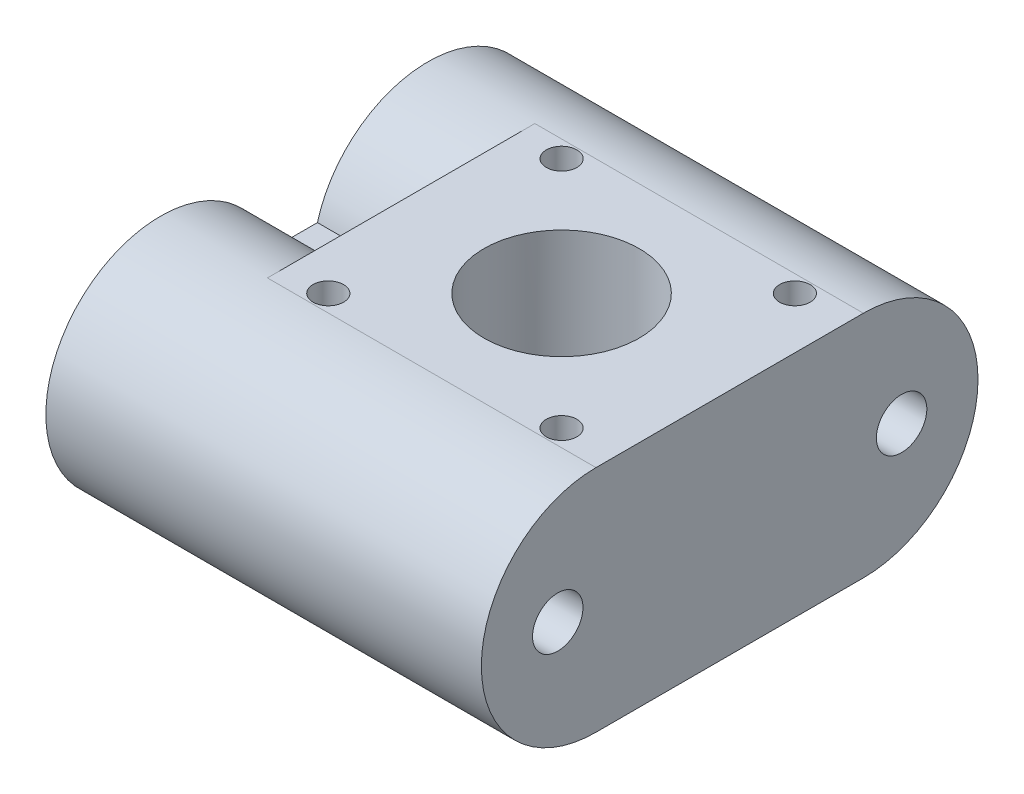
ISO-10303-21;
HEADER;
FILE_DESCRIPTION(('STEP AP214'),'2;1');
FILE_NAME('part.step','',(''),(''),'','','');
FILE_SCHEMA(('AUTOMOTIVE_DESIGN { 1 0 10303 214 1 1 1 1 }'));
ENDSEC;
DATA;
#1=APPLICATION_CONTEXT('core data for automotive mechanical design processes');
#2=APPLICATION_PROTOCOL_DEFINITION('international standard','automotive_design',2000,#1);
#3=PRODUCT_CONTEXT('',#1,'mechanical');
#4=PRODUCT('Part','Part','',(#3));
#5=PRODUCT_RELATED_PRODUCT_CATEGORY('part','',(#4));
#6=PRODUCT_DEFINITION_FORMATION('','',#4);
#7=PRODUCT_DEFINITION_CONTEXT('part definition',#1,'design');
#8=PRODUCT_DEFINITION('design','',#6,#7);
#9=PRODUCT_DEFINITION_SHAPE('','',#8);
#10=(LENGTH_UNIT() NAMED_UNIT(*) SI_UNIT(.MILLI.,.METRE.));
#11=(NAMED_UNIT(*) PLANE_ANGLE_UNIT() SI_UNIT($,.RADIAN.));
#12=(NAMED_UNIT(*) SI_UNIT($,.STERADIAN.) SOLID_ANGLE_UNIT());
#13=UNCERTAINTY_MEASURE_WITH_UNIT(LENGTH_MEASURE(1.E-05),#10,'distance_accuracy_value','');
#14=(GEOMETRIC_REPRESENTATION_CONTEXT(3) GLOBAL_UNCERTAINTY_ASSIGNED_CONTEXT((#13)) GLOBAL_UNIT_ASSIGNED_CONTEXT((#10,
#11,#12)) REPRESENTATION_CONTEXT('',''));
#15=CARTESIAN_POINT('',(0.,0.,0.));
#16=DIRECTION('',(0.,0.,1.));
#17=DIRECTION('',(1.,0.,0.));
#18=AXIS2_PLACEMENT_3D('',#15,#16,#17);
#19=CARTESIAN_POINT('',(-17.5,-15.,16.25));
#20=DIRECTION('',(-1.,0.,0.));
#21=DIRECTION('',(0.,0.,1.));
#22=AXIS2_PLACEMENT_3D('',#19,#20,#21);
#23=PLANE('',#22);
#24=CARTESIAN_POINT('',(-17.5,-7.5,-11.25));
#25=DIRECTION('',(-1.,0.,0.));
#26=DIRECTION('',(0.,0.,1.));
#27=AXIS2_PLACEMENT_3D('',#24,#25,#26);
#28=CIRCLE('',#27,1.65);
#29=CARTESIAN_POINT('',(-17.5,-7.5,-9.6));
#30=VERTEX_POINT('',#29);
#31=EDGE_CURVE('E172',#30,#30,#28,.T.);
#32=ORIENTED_EDGE('',*,*,#31,.F.);
#33=EDGE_LOOP('',(#32));
#34=FACE_BOUND('',#33,.T.);
#35=CARTESIAN_POINT('',(-17.5,-7.5,11.25));
#36=DIRECTION('',(-1.,0.,0.));
#37=DIRECTION('',(0.,0.,1.));
#38=AXIS2_PLACEMENT_3D('',#35,#36,#37);
#39=CIRCLE('',#38,1.65);
#40=CARTESIAN_POINT('',(-17.5,-7.5,12.9));
#41=VERTEX_POINT('',#40);
#42=EDGE_CURVE('E175',#41,#41,#39,.T.);
#43=ORIENTED_EDGE('',*,*,#42,.F.);
#44=EDGE_LOOP('',(#43));
#45=FACE_BOUND('',#44,.T.);
#46=DIRECTION('',(0.,0.,1.));
#47=VECTOR('',#46,1.);
#48=CARTESIAN_POINT('',(-17.5,-5.5,0.));
#49=LINE('',#48,#47);
#50=CARTESIAN_POINT('',(-17.5,-5.5,-1.52158385259952));
#51=VERTEX_POINT('',#50);
#52=CARTESIAN_POINT('',(-17.5,-5.5,1.52158385259952));
#53=VERTEX_POINT('',#52);
#54=EDGE_CURVE('E137',#51,#53,#49,.T.);
#55=ORIENTED_EDGE('',*,*,#54,.F.);
#56=CARTESIAN_POINT('',(-17.5,-7.5,-8.75));
#57=DIRECTION('',(-1.,0.,0.));
#58=DIRECTION('',(0.,0.,1.));
#59=AXIS2_PLACEMENT_3D('',#56,#57,#58);
#60=CIRCLE('',#59,7.5);
#61=CARTESIAN_POINT('',(-17.5,-9.5,-1.52158385259952));
#62=VERTEX_POINT('',#61);
#63=EDGE_CURVE('E213',#51,#62,#60,.T.);
#64=ORIENTED_EDGE('',*,*,#63,.T.);
#65=DIRECTION('',(0.,0.,1.));
#66=VECTOR('',#65,1.);
#67=CARTESIAN_POINT('',(-17.5,-9.5,0.));
#68=LINE('',#67,#66);
#69=CARTESIAN_POINT('',(-17.5,-9.5,1.52158385259952));
#70=VERTEX_POINT('',#69);
#71=EDGE_CURVE('E146',#62,#70,#68,.T.);
#72=ORIENTED_EDGE('',*,*,#71,.T.);
#73=CARTESIAN_POINT('',(-17.5,-7.5,8.75));
#74=DIRECTION('',(-1.,0.,0.));
#75=DIRECTION('',(0.,0.,1.));
#76=AXIS2_PLACEMENT_3D('',#73,#74,#75);
#77=CIRCLE('',#76,7.5);
#78=EDGE_CURVE('E73',#70,#53,#77,.T.);
#79=ORIENTED_EDGE('',*,*,#78,.T.);
#80=EDGE_LOOP('',(#55,#64,#72,#79));
#81=FACE_BOUND('',#80,.T.);
#82=ADVANCED_FACE('F64',(#34,#45,#81),#23,.T.);
#83=CARTESIAN_POINT('',(0.,-15.,0.));
#84=DIRECTION('',(0.,-1.,0.));
#85=DIRECTION('',(0.,0.,-1.));
#86=AXIS2_PLACEMENT_3D('',#83,#84,#85);
#87=PLANE('',#86);
#88=CARTESIAN_POINT('',(7.633,-15.,7.633));
#89=DIRECTION('',(0.,1.,0.));
#90=DIRECTION('',(0.,0.,1.));
#91=AXIS2_PLACEMENT_3D('',#88,#89,#90);
#92=CIRCLE('',#91,1.);
#93=CARTESIAN_POINT('',(7.633,-15.,8.633));
#94=VERTEX_POINT('',#93);
#95=EDGE_CURVE('E179',#94,#94,#92,.T.);
#96=ORIENTED_EDGE('',*,*,#95,.T.);
#97=EDGE_LOOP('',(#96));
#98=FACE_BOUND('',#97,.T.);
#99=CARTESIAN_POINT('',(-7.633,-15.,7.633));
#100=DIRECTION('',(0.,1.,0.));
#101=DIRECTION('',(0.,0.,1.));
#102=AXIS2_PLACEMENT_3D('',#99,#100,#101);
#103=CIRCLE('',#102,1.);
#104=CARTESIAN_POINT('',(-7.633,-15.,8.633));
#105=VERTEX_POINT('',#104);
#106=EDGE_CURVE('E185',#105,#105,#103,.T.);
#107=ORIENTED_EDGE('',*,*,#106,.T.);
#108=EDGE_LOOP('',(#107));
#109=FACE_BOUND('',#108,.T.);
#110=CARTESIAN_POINT('',(-7.633,-15.,-7.633));
#111=DIRECTION('',(0.,1.,0.));
#112=DIRECTION('',(0.,0.,1.));
#113=AXIS2_PLACEMENT_3D('',#110,#111,#112);
#114=CIRCLE('',#113,1.);
#115=CARTESIAN_POINT('',(-7.633,-15.,-6.633));
#116=VERTEX_POINT('',#115);
#117=EDGE_CURVE('E191',#116,#116,#114,.T.);
#118=ORIENTED_EDGE('',*,*,#117,.T.);
#119=EDGE_LOOP('',(#118));
#120=FACE_BOUND('',#119,.T.);
#121=CARTESIAN_POINT('',(7.633,-15.,-7.633));
#122=DIRECTION('',(0.,1.,0.));
#123=DIRECTION('',(0.,0.,1.));
#124=AXIS2_PLACEMENT_3D('',#121,#122,#123);
#125=CIRCLE('',#124,0.999999999999999);
#126=CARTESIAN_POINT('',(7.633,-15.,-6.633));
#127=VERTEX_POINT('',#126);
#128=EDGE_CURVE('E197',#127,#127,#125,.T.);
#129=ORIENTED_EDGE('',*,*,#128,.T.);
#130=EDGE_LOOP('',(#129));
#131=FACE_BOUND('',#130,.T.);
#132=CARTESIAN_POINT('',(0.,-15.,0.));
#133=DIRECTION('',(0.,-1.,0.));
#134=DIRECTION('',(0.,0.,-1.));
#135=AXIS2_PLACEMENT_3D('',#132,#133,#134);
#136=CIRCLE('',#135,5.08);
#137=CARTESIAN_POINT('',(0.,-15.,-5.08));
#138=VERTEX_POINT('',#137);
#139=EDGE_CURVE('E205',#138,#138,#136,.T.);
#140=ORIENTED_EDGE('',*,*,#139,.F.);
#141=EDGE_LOOP('',(#140));
#142=FACE_BOUND('',#141,.T.);
#143=DIRECTION('',(1.,0.,0.));
#144=VECTOR('',#143,1.);
#145=CARTESIAN_POINT('',(0.,-15.,8.75));
#146=LINE('',#145,#144);
#147=CARTESIAN_POINT('',(11.,-15.,8.75));
#148=VERTEX_POINT('',#147);
#149=CARTESIAN_POINT('',(-10.5,-15.,8.75));
#150=VERTEX_POINT('',#149);
#151=EDGE_CURVE('E217',#148,#150,#146,.F.);
#152=ORIENTED_EDGE('',*,*,#151,.T.);
#153=DIRECTION('',(0.,0.,-1.));
#154=VECTOR('',#153,1.);
#155=CARTESIAN_POINT('',(-10.5,-15.,0.));
#156=LINE('',#155,#154);
#157=CARTESIAN_POINT('',(-10.5,-15.,-8.75));
#158=VERTEX_POINT('',#157);
#159=EDGE_CURVE('E135',#150,#158,#156,.T.);
#160=ORIENTED_EDGE('',*,*,#159,.T.);
#161=DIRECTION('',(-1.,0.,0.));
#162=VECTOR('',#161,1.);
#163=CARTESIAN_POINT('',(0.,-15.,-8.75));
#164=LINE('',#163,#162);
#165=CARTESIAN_POINT('',(11.,-15.,-8.75));
#166=VERTEX_POINT('',#165);
#167=EDGE_CURVE('E208',#158,#166,#164,.F.);
#168=ORIENTED_EDGE('',*,*,#167,.T.);
#169=DIRECTION('',(0.,0.,-1.));
#170=VECTOR('',#169,1.);
#171=CARTESIAN_POINT('',(11.,-15.,16.25));
#172=LINE('',#171,#170);
#173=EDGE_CURVE('E161',#148,#166,#172,.T.);
#174=ORIENTED_EDGE('',*,*,#173,.F.);
#175=EDGE_LOOP('',(#152,#160,#168,#174));
#176=FACE_BOUND('',#175,.T.);
#177=ADVANCED_FACE('F241',(#98,#109,#120,#131,#142,#176),#87,.T.);
#178=CARTESIAN_POINT('',(0.,0.,0.));
#179=DIRECTION('',(0.,-1.,0.));
#180=DIRECTION('',(0.,0.,-1.));
#181=AXIS2_PLACEMENT_3D('',#178,#179,#180);
#182=PLANE('',#181);
#183=CARTESIAN_POINT('',(0.,0.,0.));
#184=DIRECTION('',(0.,1.,0.));
#185=DIRECTION('',(0.,0.,1.));
#186=AXIS2_PLACEMENT_3D('',#183,#184,#185);
#187=CIRCLE('',#186,5.08);
#188=CARTESIAN_POINT('',(0.,0.,5.08));
#189=VERTEX_POINT('',#188);
#190=EDGE_CURVE('E200',#189,#189,#187,.T.);
#191=ORIENTED_EDGE('',*,*,#190,.F.);
#192=EDGE_LOOP('',(#191));
#193=FACE_BOUND('',#192,.T.);
#194=CARTESIAN_POINT('',(7.633,0.,-7.633));
#195=DIRECTION('',(0.,1.,0.));
#196=DIRECTION('',(0.,0.,1.));
#197=AXIS2_PLACEMENT_3D('',#194,#195,#196);
#198=CIRCLE('',#197,0.999999999999999);
#199=CARTESIAN_POINT('',(7.633,0.,-6.633));
#200=VERTEX_POINT('',#199);
#201=EDGE_CURVE('E194',#200,#200,#198,.T.);
#202=ORIENTED_EDGE('',*,*,#201,.F.);
#203=EDGE_LOOP('',(#202));
#204=FACE_BOUND('',#203,.T.);
#205=CARTESIAN_POINT('',(-7.633,0.,-7.633));
#206=DIRECTION('',(0.,1.,0.));
#207=DIRECTION('',(0.,0.,1.));
#208=AXIS2_PLACEMENT_3D('',#205,#206,#207);
#209=CIRCLE('',#208,1.);
#210=CARTESIAN_POINT('',(-7.633,0.,-6.633));
#211=VERTEX_POINT('',#210);
#212=EDGE_CURVE('E188',#211,#211,#209,.T.);
#213=ORIENTED_EDGE('',*,*,#212,.F.);
#214=EDGE_LOOP('',(#213));
#215=FACE_BOUND('',#214,.T.);
#216=CARTESIAN_POINT('',(-7.633,0.,7.633));
#217=DIRECTION('',(0.,1.,0.));
#218=DIRECTION('',(0.,0.,1.));
#219=AXIS2_PLACEMENT_3D('',#216,#217,#218);
#220=CIRCLE('',#219,1.);
#221=CARTESIAN_POINT('',(-7.633,0.,8.633));
#222=VERTEX_POINT('',#221);
#223=EDGE_CURVE('E182',#222,#222,#220,.T.);
#224=ORIENTED_EDGE('',*,*,#223,.F.);
#225=EDGE_LOOP('',(#224));
#226=FACE_BOUND('',#225,.T.);
#227=CARTESIAN_POINT('',(7.633,0.,7.633));
#228=DIRECTION('',(0.,1.,0.));
#229=DIRECTION('',(0.,0.,1.));
#230=AXIS2_PLACEMENT_3D('',#227,#228,#229);
#231=CIRCLE('',#230,1.);
#232=CARTESIAN_POINT('',(7.633,0.,8.633));
#233=VERTEX_POINT('',#232);
#234=EDGE_CURVE('E178',#233,#233,#231,.T.);
#235=ORIENTED_EDGE('',*,*,#234,.F.);
#236=EDGE_LOOP('',(#235));
#237=FACE_BOUND('',#236,.T.);
#238=DIRECTION('',(0.,0.,-1.));
#239=VECTOR('',#238,1.);
#240=CARTESIAN_POINT('',(-10.5,0.,0.));
#241=LINE('',#240,#239);
#242=CARTESIAN_POINT('',(-10.5,0.,8.75));
#243=VERTEX_POINT('',#242);
#244=CARTESIAN_POINT('',(-10.5,0.,-8.75));
#245=VERTEX_POINT('',#244);
#246=EDGE_CURVE('E13',#243,#245,#241,.T.);
#247=ORIENTED_EDGE('',*,*,#246,.F.);
#248=DIRECTION('',(-1.,0.,0.));
#249=VECTOR('',#248,1.);
#250=CARTESIAN_POINT('',(-17.5,0.,8.75));
#251=LINE('',#250,#249);
#252=CARTESIAN_POINT('',(11.,0.,8.75));
#253=VERTEX_POINT('',#252);
#254=EDGE_CURVE('E215',#243,#253,#251,.F.);
#255=ORIENTED_EDGE('',*,*,#254,.T.);
#256=DIRECTION('',(0.,0.,-1.));
#257=VECTOR('',#256,1.);
#258=CARTESIAN_POINT('',(11.,0.,16.25));
#259=LINE('',#258,#257);
#260=CARTESIAN_POINT('',(11.,0.,-8.75));
#261=VERTEX_POINT('',#260);
#262=EDGE_CURVE('E162',#253,#261,#259,.T.);
#263=ORIENTED_EDGE('',*,*,#262,.T.);
#264=DIRECTION('',(1.,0.,0.));
#265=VECTOR('',#264,1.);
#266=CARTESIAN_POINT('',(-17.5,0.,-8.75));
#267=LINE('',#266,#265);
#268=EDGE_CURVE('E210',#261,#245,#267,.F.);
#269=ORIENTED_EDGE('',*,*,#268,.T.);
#270=EDGE_LOOP('',(#247,#255,#263,#269));
#271=FACE_BOUND('',#270,.T.);
#272=ADVANCED_FACE('F270',(#193,#204,#215,#226,#237,#271),#182,.F.);
#273=CARTESIAN_POINT('',(-17.5,-7.5,8.75));
#274=DIRECTION('',(1.,0.,0.));
#275=DIRECTION('',(0.,0.,-1.));
#276=AXIS2_PLACEMENT_3D('',#273,#274,#275);
#277=CYLINDRICAL_SURFACE('',#276,7.5);
#278=CARTESIAN_POINT('',(-10.5,-7.5,8.75));
#279=DIRECTION('',(-1.,0.,0.));
#280=DIRECTION('',(0.,0.,1.));
#281=AXIS2_PLACEMENT_3D('',#278,#279,#280);
#282=CIRCLE('',#281,7.5);
#283=CARTESIAN_POINT('',(-10.5,-9.5,1.52158385259952));
#284=VERTEX_POINT('',#283);
#285=EDGE_CURVE('E80',#284,#150,#282,.T.);
#286=ORIENTED_EDGE('',*,*,#285,.T.);
#287=ORIENTED_EDGE('',*,*,#151,.F.);
#288=CARTESIAN_POINT('',(11.,-7.5,8.75));
#289=DIRECTION('',(-1.,0.,0.));
#290=DIRECTION('',(0.,0.,1.));
#291=AXIS2_PLACEMENT_3D('',#288,#289,#290);
#292=CIRCLE('',#291,7.5);
#293=EDGE_CURVE('E170',#253,#148,#292,.F.);
#294=ORIENTED_EDGE('',*,*,#293,.F.);
#295=ORIENTED_EDGE('',*,*,#254,.F.);
#296=CARTESIAN_POINT('',(-10.5,-5.5,1.52158385259952));
#297=VERTEX_POINT('',#296);
#298=EDGE_CURVE('E138',#243,#297,#282,.T.);
#299=ORIENTED_EDGE('',*,*,#298,.T.);
#300=DIRECTION('',(-1.,0.,0.));
#301=VECTOR('',#300,1.);
#302=CARTESIAN_POINT('',(-10.5,-5.5,1.52158385259952));
#303=LINE('',#302,#301);
#304=EDGE_CURVE('E147',#297,#53,#303,.T.);
#305=ORIENTED_EDGE('',*,*,#304,.T.);
#306=ORIENTED_EDGE('',*,*,#78,.F.);
#307=DIRECTION('',(-1.,0.,0.));
#308=VECTOR('',#307,1.);
#309=CARTESIAN_POINT('',(-10.5,-9.5,1.52158385259952));
#310=LINE('',#309,#308);
#311=EDGE_CURVE('E141',#284,#70,#310,.T.);
#312=ORIENTED_EDGE('',*,*,#311,.F.);
#313=EDGE_LOOP('',(#286,#287,#294,#295,#299,#305,#306,#312));
#314=FACE_BOUND('',#313,.T.);
#315=ADVANCED_FACE('F67',(#314),#277,.T.);
#316=CARTESIAN_POINT('',(-17.5,-7.5,-8.75));
#317=DIRECTION('',(-1.,0.,0.));
#318=DIRECTION('',(0.,0.,1.));
#319=AXIS2_PLACEMENT_3D('',#316,#317,#318);
#320=CYLINDRICAL_SURFACE('',#319,7.5);
#321=CARTESIAN_POINT('',(-10.5,-7.5,-8.75));
#322=DIRECTION('',(-1.,0.,0.));
#323=DIRECTION('',(0.,0.,1.));
#324=AXIS2_PLACEMENT_3D('',#321,#322,#323);
#325=CIRCLE('',#324,7.5);
#326=CARTESIAN_POINT('',(-10.5,-5.5,-1.52158385259952));
#327=VERTEX_POINT('',#326);
#328=EDGE_CURVE('E153',#327,#245,#325,.T.);
#329=ORIENTED_EDGE('',*,*,#328,.T.);
#330=ORIENTED_EDGE('',*,*,#268,.F.);
#331=CARTESIAN_POINT('',(11.,-7.5,-8.75));
#332=DIRECTION('',(-1.,0.,0.));
#333=DIRECTION('',(0.,0.,1.));
#334=AXIS2_PLACEMENT_3D('',#331,#332,#333);
#335=CIRCLE('',#334,7.5);
#336=EDGE_CURVE('E88',#166,#261,#335,.F.);
#337=ORIENTED_EDGE('',*,*,#336,.F.);
#338=ORIENTED_EDGE('',*,*,#167,.F.);
#339=CARTESIAN_POINT('',(-10.5,-9.5,-1.52158385259952));
#340=VERTEX_POINT('',#339);
#341=EDGE_CURVE('E156',#158,#340,#325,.T.);
#342=ORIENTED_EDGE('',*,*,#341,.T.);
#343=DIRECTION('',(-1.,0.,0.));
#344=VECTOR('',#343,1.);
#345=CARTESIAN_POINT('',(-10.5,-9.5,-1.52158385259952));
#346=LINE('',#345,#344);
#347=EDGE_CURVE('E152',#340,#62,#346,.T.);
#348=ORIENTED_EDGE('',*,*,#347,.T.);
#349=ORIENTED_EDGE('',*,*,#63,.F.);
#350=DIRECTION('',(-1.,0.,0.));
#351=VECTOR('',#350,1.);
#352=CARTESIAN_POINT('',(-10.5,-5.5,-1.52158385259952));
#353=LINE('',#352,#351);
#354=EDGE_CURVE('E249',#327,#51,#353,.T.);
#355=ORIENTED_EDGE('',*,*,#354,.F.);
#356=EDGE_LOOP('',(#329,#330,#337,#338,#342,#348,#349,#355));
#357=FACE_BOUND('',#356,.T.);
#358=ADVANCED_FACE('F261',(#357),#320,.T.);
#359=CARTESIAN_POINT('',(0.,-30.,0.));
#360=DIRECTION('',(0.,1.,0.));
#361=DIRECTION('',(0.,0.,1.));
#362=AXIS2_PLACEMENT_3D('',#359,#360,#361);
#363=CYLINDRICAL_SURFACE('',#362,5.08);
#364=ORIENTED_EDGE('',*,*,#139,.T.);
#365=EDGE_LOOP('',(#364));
#366=FACE_BOUND('',#365,.T.);
#367=ORIENTED_EDGE('',*,*,#190,.T.);
#368=EDGE_LOOP('',(#367));
#369=FACE_BOUND('',#368,.T.);
#370=ADVANCED_FACE('F297',(#366,#369),#363,.F.);
#371=CARTESIAN_POINT('',(7.633,-15.,-7.633));
#372=DIRECTION('',(0.,1.,0.));
#373=DIRECTION('',(0.,0.,1.));
#374=AXIS2_PLACEMENT_3D('',#371,#372,#373);
#375=CYLINDRICAL_SURFACE('',#374,0.999999999999999);
#376=ORIENTED_EDGE('',*,*,#128,.F.);
#377=EDGE_LOOP('',(#376));
#378=FACE_BOUND('',#377,.T.);
#379=ORIENTED_EDGE('',*,*,#201,.T.);
#380=EDGE_LOOP('',(#379));
#381=FACE_BOUND('',#380,.T.);
#382=ADVANCED_FACE('F293',(#378,#381),#375,.F.);
#383=CARTESIAN_POINT('',(-7.633,-15.,-7.633));
#384=DIRECTION('',(0.,1.,0.));
#385=DIRECTION('',(0.,0.,1.));
#386=AXIS2_PLACEMENT_3D('',#383,#384,#385);
#387=CYLINDRICAL_SURFACE('',#386,1.);
#388=ORIENTED_EDGE('',*,*,#117,.F.);
#389=EDGE_LOOP('',(#388));
#390=FACE_BOUND('',#389,.T.);
#391=ORIENTED_EDGE('',*,*,#212,.T.);
#392=EDGE_LOOP('',(#391));
#393=FACE_BOUND('',#392,.T.);
#394=ADVANCED_FACE('F289',(#390,#393),#387,.F.);
#395=CARTESIAN_POINT('',(-7.633,-15.,7.633));
#396=DIRECTION('',(0.,1.,0.));
#397=DIRECTION('',(0.,0.,1.));
#398=AXIS2_PLACEMENT_3D('',#395,#396,#397);
#399=CYLINDRICAL_SURFACE('',#398,1.);
#400=ORIENTED_EDGE('',*,*,#106,.F.);
#401=EDGE_LOOP('',(#400));
#402=FACE_BOUND('',#401,.T.);
#403=ORIENTED_EDGE('',*,*,#223,.T.);
#404=EDGE_LOOP('',(#403));
#405=FACE_BOUND('',#404,.T.);
#406=ADVANCED_FACE('F285',(#402,#405),#399,.F.);
#407=CARTESIAN_POINT('',(7.633,-15.,7.633));
#408=DIRECTION('',(0.,1.,0.));
#409=DIRECTION('',(0.,0.,1.));
#410=AXIS2_PLACEMENT_3D('',#407,#408,#409);
#411=CYLINDRICAL_SURFACE('',#410,1.);
#412=ORIENTED_EDGE('',*,*,#95,.F.);
#413=EDGE_LOOP('',(#412));
#414=FACE_BOUND('',#413,.T.);
#415=ORIENTED_EDGE('',*,*,#234,.T.);
#416=EDGE_LOOP('',(#415));
#417=FACE_BOUND('',#416,.T.);
#418=ADVANCED_FACE('F235',(#414,#417),#411,.F.);
#419=CARTESIAN_POINT('',(-17.5,-7.5,11.25));
#420=DIRECTION('',(-1.,0.,0.));
#421=DIRECTION('',(0.,0.,1.));
#422=AXIS2_PLACEMENT_3D('',#419,#420,#421);
#423=CYLINDRICAL_SURFACE('',#422,1.65);
#424=CARTESIAN_POINT('',(11.,-7.5,11.25));
#425=DIRECTION('',(-1.,0.,0.));
#426=DIRECTION('',(0.,0.,1.));
#427=AXIS2_PLACEMENT_3D('',#424,#425,#426);
#428=CIRCLE('',#427,1.65);
#429=CARTESIAN_POINT('',(11.,-7.5,12.9));
#430=VERTEX_POINT('',#429);
#431=EDGE_CURVE('E166',#430,#430,#428,.F.);
#432=ORIENTED_EDGE('',*,*,#431,.T.);
#433=EDGE_LOOP('',(#432));
#434=FACE_BOUND('',#433,.T.);
#435=ORIENTED_EDGE('',*,*,#42,.T.);
#436=EDGE_LOOP('',(#435));
#437=FACE_BOUND('',#436,.T.);
#438=ADVANCED_FACE('F232',(#434,#437),#423,.F.);
#439=CARTESIAN_POINT('',(-17.5,-7.5,-11.25));
#440=DIRECTION('',(-1.,0.,0.));
#441=DIRECTION('',(0.,0.,1.));
#442=AXIS2_PLACEMENT_3D('',#439,#440,#441);
#443=CYLINDRICAL_SURFACE('',#442,1.65);
#444=CARTESIAN_POINT('',(11.,-7.5,-11.25));
#445=DIRECTION('',(-1.,0.,0.));
#446=DIRECTION('',(0.,0.,1.));
#447=AXIS2_PLACEMENT_3D('',#444,#445,#446);
#448=CIRCLE('',#447,1.65);
#449=CARTESIAN_POINT('',(11.,-7.5,-9.6));
#450=VERTEX_POINT('',#449);
#451=EDGE_CURVE('E164',#450,#450,#448,.F.);
#452=ORIENTED_EDGE('',*,*,#451,.T.);
#453=EDGE_LOOP('',(#452));
#454=FACE_BOUND('',#453,.T.);
#455=ORIENTED_EDGE('',*,*,#31,.T.);
#456=EDGE_LOOP('',(#455));
#457=FACE_BOUND('',#456,.T.);
#458=ADVANCED_FACE('F222',(#454,#457),#443,.F.);
#459=CARTESIAN_POINT('',(11.,0.,16.25));
#460=DIRECTION('',(-1.,0.,0.));
#461=DIRECTION('',(0.,0.,1.));
#462=AXIS2_PLACEMENT_3D('',#459,#460,#461);
#463=PLANE('',#462);
#464=ORIENTED_EDGE('',*,*,#293,.T.);
#465=ORIENTED_EDGE('',*,*,#173,.T.);
#466=ORIENTED_EDGE('',*,*,#336,.T.);
#467=ORIENTED_EDGE('',*,*,#262,.F.);
#468=EDGE_LOOP('',(#464,#465,#466,#467));
#469=FACE_BOUND('',#468,.T.);
#470=ORIENTED_EDGE('',*,*,#451,.F.);
#471=EDGE_LOOP('',(#470));
#472=FACE_BOUND('',#471,.T.);
#473=ORIENTED_EDGE('',*,*,#431,.F.);
#474=EDGE_LOOP('',(#473));
#475=FACE_BOUND('',#474,.T.);
#476=ADVANCED_FACE('F225',(#469,#472,#475),#463,.F.);
#477=CARTESIAN_POINT('',(-10.5,-7.5,0.));
#478=DIRECTION('',(-1.,0.,0.));
#479=DIRECTION('',(0.,0.,1.));
#480=AXIS2_PLACEMENT_3D('',#477,#478,#479);
#481=PLANE('',#480);
#482=ORIENTED_EDGE('',*,*,#246,.T.);
#483=ORIENTED_EDGE('',*,*,#328,.F.);
#484=DIRECTION('',(0.,0.,1.));
#485=VECTOR('',#484,1.);
#486=CARTESIAN_POINT('',(-10.5,-5.5,0.));
#487=LINE('',#486,#485);
#488=EDGE_CURVE('E251',#327,#297,#487,.T.);
#489=ORIENTED_EDGE('',*,*,#488,.T.);
#490=ORIENTED_EDGE('',*,*,#298,.F.);
#491=EDGE_LOOP('',(#482,#483,#489,#490));
#492=FACE_BOUND('',#491,.T.);
#493=ADVANCED_FACE('F228',(#492),#481,.T.);
#494=CARTESIAN_POINT('',(-10.5,-5.5,0.));
#495=DIRECTION('',(0.,-1.,0.));
#496=DIRECTION('',(0.,0.,-1.));
#497=AXIS2_PLACEMENT_3D('',#494,#495,#496);
#498=PLANE('',#497);
#499=ORIENTED_EDGE('',*,*,#54,.T.);
#500=ORIENTED_EDGE('',*,*,#304,.F.);
#501=ORIENTED_EDGE('',*,*,#488,.F.);
#502=ORIENTED_EDGE('',*,*,#354,.T.);
#503=EDGE_LOOP('',(#499,#500,#501,#502));
#504=FACE_BOUND('',#503,.T.);
#505=ADVANCED_FACE('F271',(#504),#498,.F.);
#506=ORIENTED_EDGE('',*,*,#285,.F.);
#507=DIRECTION('',(0.,0.,1.));
#508=VECTOR('',#507,1.);
#509=CARTESIAN_POINT('',(-10.5,-9.5,0.));
#510=LINE('',#509,#508);
#511=EDGE_CURVE('E133',#340,#284,#510,.T.);
#512=ORIENTED_EDGE('',*,*,#511,.F.);
#513=ORIENTED_EDGE('',*,*,#341,.F.);
#514=ORIENTED_EDGE('',*,*,#159,.F.);
#515=EDGE_LOOP('',(#506,#512,#513,#514));
#516=FACE_BOUND('',#515,.T.);
#517=ADVANCED_FACE('F131',(#516),#481,.T.);
#518=CARTESIAN_POINT('',(-10.5,-9.5,0.));
#519=DIRECTION('',(0.,-1.,0.));
#520=DIRECTION('',(0.,0.,-1.));
#521=AXIS2_PLACEMENT_3D('',#518,#519,#520);
#522=PLANE('',#521);
#523=ORIENTED_EDGE('',*,*,#71,.F.);
#524=ORIENTED_EDGE('',*,*,#347,.F.);
#525=ORIENTED_EDGE('',*,*,#511,.T.);
#526=ORIENTED_EDGE('',*,*,#311,.T.);
#527=EDGE_LOOP('',(#523,#524,#525,#526));
#528=FACE_BOUND('',#527,.T.);
#529=ADVANCED_FACE('F150',(#528),#522,.T.);
#530=CLOSED_SHELL('',(#82,#177,#272,#315,#358,#370,#382,#394,#406,#418,#438,#458,#476,#493,#505,
#517,#529));
#531=MANIFOLD_SOLID_BREP('B2',#530);
#532=ADVANCED_BREP_SHAPE_REPRESENTATION('',(#18,#531),#14);
#533=SHAPE_DEFINITION_REPRESENTATION(#9,#532);
ENDSEC;
END-ISO-10303-21;
